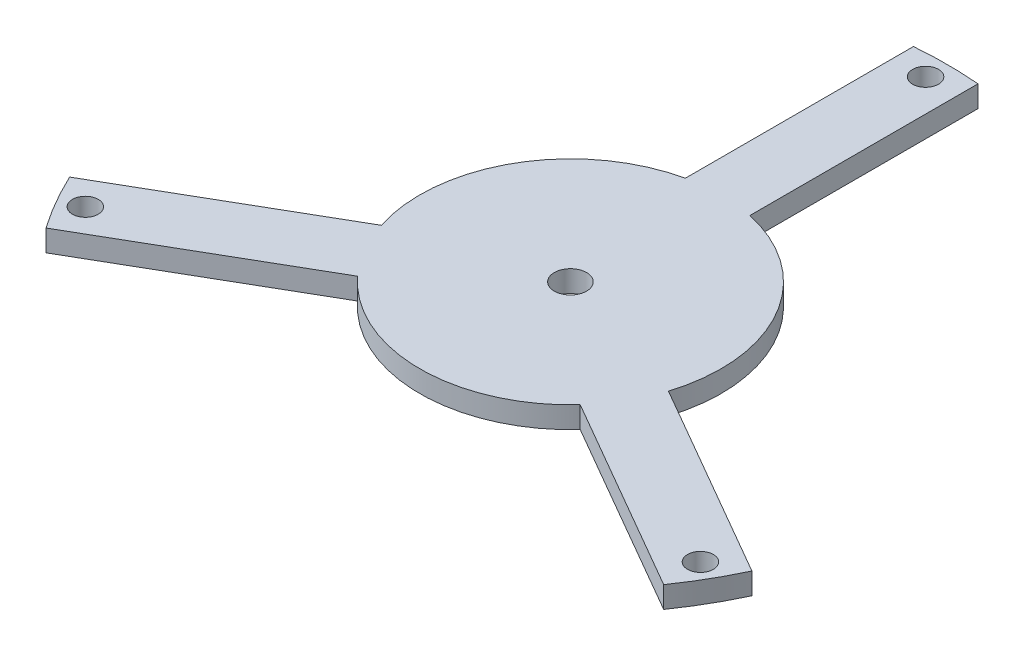
ISO-10303-21;
HEADER;
FILE_DESCRIPTION(('STEP AP214'),'2;1');
FILE_NAME('part.step','',(''),(''),'','','');
FILE_SCHEMA(('AUTOMOTIVE_DESIGN { 1 0 10303 214 1 1 1 1 }'));
ENDSEC;
DATA;
#1=APPLICATION_CONTEXT('core data for automotive mechanical design processes');
#2=APPLICATION_PROTOCOL_DEFINITION('international standard','automotive_design',2000,#1);
#3=PRODUCT_CONTEXT('',#1,'mechanical');
#4=PRODUCT('Part','Part','',(#3));
#5=PRODUCT_RELATED_PRODUCT_CATEGORY('part','',(#4));
#6=PRODUCT_DEFINITION_FORMATION('','',#4);
#7=PRODUCT_DEFINITION_CONTEXT('part definition',#1,'design');
#8=PRODUCT_DEFINITION('design','',#6,#7);
#9=PRODUCT_DEFINITION_SHAPE('','',#8);
#10=(LENGTH_UNIT() NAMED_UNIT(*) SI_UNIT(.MILLI.,.METRE.));
#11=(NAMED_UNIT(*) PLANE_ANGLE_UNIT() SI_UNIT($,.RADIAN.));
#12=(NAMED_UNIT(*) SI_UNIT($,.STERADIAN.) SOLID_ANGLE_UNIT());
#13=UNCERTAINTY_MEASURE_WITH_UNIT(LENGTH_MEASURE(1.E-05),#10,'distance_accuracy_value','');
#14=(GEOMETRIC_REPRESENTATION_CONTEXT(3) GLOBAL_UNCERTAINTY_ASSIGNED_CONTEXT((#13)) GLOBAL_UNIT_ASSIGNED_CONTEXT((#10,
#11,#12)) REPRESENTATION_CONTEXT('',''));
#15=CARTESIAN_POINT('',(0.,0.,0.));
#16=DIRECTION('',(0.,0.,1.));
#17=DIRECTION('',(1.,0.,0.));
#18=AXIS2_PLACEMENT_3D('',#15,#16,#17);
#19=CARTESIAN_POINT('',(0.,10.,0.));
#20=DIRECTION('',(0.,1.,0.));
#21=DIRECTION('',(0.,0.,1.));
#22=AXIS2_PLACEMENT_3D('',#19,#20,#21);
#23=PLANE('',#22);
#24=CARTESIAN_POINT('',(0.,10.,0.));
#25=DIRECTION('',(0.,1.,0.));
#26=DIRECTION('',(0.,0.,1.));
#27=AXIS2_PLACEMENT_3D('',#24,#25,#26);
#28=CIRCLE('',#27,7.5);
#29=CARTESIAN_POINT('',(0.,10.,7.5));
#30=VERTEX_POINT('',#29);
#31=EDGE_CURVE('E287',#30,#30,#28,.T.);
#32=ORIENTED_EDGE('',*,*,#31,.F.);
#33=EDGE_LOOP('',(#32));
#34=FACE_BOUND('',#33,.T.);
#35=CARTESIAN_POINT('',(142.894191624441,10.,82.4999999999948));
#36=DIRECTION('',(0.,1.,0.));
#37=DIRECTION('',(0.,0.,1.));
#38=AXIS2_PLACEMENT_3D('',#35,#36,#37);
#39=CIRCLE('',#38,6.00000000000002);
#40=CARTESIAN_POINT('',(142.894191624441,10.,88.4999999999949));
#41=VERTEX_POINT('',#40);
#42=EDGE_CURVE('E298',#41,#41,#39,.T.);
#43=ORIENTED_EDGE('',*,*,#42,.F.);
#44=EDGE_LOOP('',(#43));
#45=FACE_BOUND('',#44,.T.);
#46=CARTESIAN_POINT('',(0.,10.,0.));
#47=DIRECTION('',(0.,1.,0.));
#48=DIRECTION('',(0.,0.,1.));
#49=AXIS2_PLACEMENT_3D('',#46,#47,#48);
#50=CIRCLE('',#49,175.);
#51=CARTESIAN_POINT('',(15.,10.,-174.355957741627));
#52=VERTEX_POINT('',#51);
#53=CARTESIAN_POINT('',(-15.,10.,-174.355957741627));
#54=VERTEX_POINT('',#53);
#55=EDGE_CURVE('E179',#52,#54,#50,.T.);
#56=ORIENTED_EDGE('',*,*,#55,.T.);
#57=DIRECTION('',(0.,0.,1.));
#58=VECTOR('',#57,1.);
#59=CARTESIAN_POINT('',(-15.,10.,-174.355957741627));
#60=LINE('',#59,#58);
#61=CARTESIAN_POINT('',(-15.,10.,-68.3739716558867));
#62=VERTEX_POINT('',#61);
#63=EDGE_CURVE('E107',#54,#62,#60,.T.);
#64=ORIENTED_EDGE('',*,*,#63,.T.);
#65=CARTESIAN_POINT('',(0.,10.,0.));
#66=DIRECTION('',(0.,1.,0.));
#67=DIRECTION('',(0.,0.,1.));
#68=AXIS2_PLACEMENT_3D('',#65,#66,#67);
#69=CIRCLE('',#68,70.);
#70=CARTESIAN_POINT('',(-66.7135964116335,10.,21.1966047711816));
#71=VERTEX_POINT('',#70);
#72=EDGE_CURVE('E206',#62,#71,#69,.T.);
#73=ORIENTED_EDGE('',*,*,#72,.T.);
#74=DIRECTION('',(-0.866025403784439,0.,0.5));
#75=VECTOR('',#74,1.);
#76=CARTESIAN_POINT('',(-158.496688705413,10.,74.1875978140514));
#77=LINE('',#76,#75);
#78=CARTESIAN_POINT('',(-158.496688705413,10.,74.1875978140514));
#79=VERTEX_POINT('',#78);
#80=EDGE_CURVE('E225',#71,#79,#77,.T.);
#81=ORIENTED_EDGE('',*,*,#80,.T.);
#82=CARTESIAN_POINT('',(0.,10.,0.));
#83=DIRECTION('',(0.,1.,0.));
#84=DIRECTION('',(0.,0.,1.));
#85=AXIS2_PLACEMENT_3D('',#82,#83,#84);
#86=CIRCLE('',#85,175.);
#87=CARTESIAN_POINT('',(-143.496688705412,10.,100.168359927584));
#88=VERTEX_POINT('',#87);
#89=EDGE_CURVE('E222',#79,#88,#86,.T.);
#90=ORIENTED_EDGE('',*,*,#89,.T.);
#91=DIRECTION('',(0.866025403784439,0.,-0.5));
#92=VECTOR('',#91,1.);
#93=CARTESIAN_POINT('',(-143.496688705412,10.,100.168359927584));
#94=LINE('',#93,#92);
#95=CARTESIAN_POINT('',(-51.7135964116316,10.,47.1773668847137));
#96=VERTEX_POINT('',#95);
#97=EDGE_CURVE('E224',#88,#96,#94,.T.);
#98=ORIENTED_EDGE('',*,*,#97,.T.);
#99=CARTESIAN_POINT('',(0.,10.,0.));
#100=DIRECTION('',(0.,1.,0.));
#101=DIRECTION('',(0.,0.,1.));
#102=AXIS2_PLACEMENT_3D('',#99,#100,#101);
#103=CIRCLE('',#102,70.);
#104=CARTESIAN_POINT('',(51.7135964116393,10.,47.1773668847053));
#105=VERTEX_POINT('',#104);
#106=EDGE_CURVE('E227',#96,#105,#103,.T.);
#107=ORIENTED_EDGE('',*,*,#106,.T.);
#108=DIRECTION('',(0.866025403784439,0.,0.5));
#109=VECTOR('',#108,1.);
#110=CARTESIAN_POINT('',(143.496688705419,10.,100.168359927575));
#111=LINE('',#110,#109);
#112=CARTESIAN_POINT('',(143.496688705419,10.,100.168359927575));
#113=VERTEX_POINT('',#112);
#114=EDGE_CURVE('E233',#105,#113,#111,.T.);
#115=ORIENTED_EDGE('',*,*,#114,.T.);
#116=CARTESIAN_POINT('',(0.,10.,0.));
#117=DIRECTION('',(0.,1.,0.));
#118=DIRECTION('',(0.,0.,1.));
#119=AXIS2_PLACEMENT_3D('',#116,#117,#118);
#120=CIRCLE('',#119,175.);
#121=CARTESIAN_POINT('',(158.496688705418,10.,74.1875978140412));
#122=VERTEX_POINT('',#121);
#123=EDGE_CURVE('E138',#113,#122,#120,.T.);
#124=ORIENTED_EDGE('',*,*,#123,.T.);
#125=DIRECTION('',(-0.866025403784439,0.,-0.5));
#126=VECTOR('',#125,1.);
#127=CARTESIAN_POINT('',(158.496688705418,10.,74.1875978140413));
#128=LINE('',#127,#126);
#129=CARTESIAN_POINT('',(66.713596411637,10.,21.1966047711708));
#130=VERTEX_POINT('',#129);
#131=EDGE_CURVE('E132',#122,#130,#128,.T.);
#132=ORIENTED_EDGE('',*,*,#131,.T.);
#133=CARTESIAN_POINT('',(0.,10.,0.));
#134=DIRECTION('',(0.,1.,0.));
#135=DIRECTION('',(0.,0.,1.));
#136=AXIS2_PLACEMENT_3D('',#133,#134,#135);
#137=CIRCLE('',#136,70.);
#138=CARTESIAN_POINT('',(15.,10.,-68.3739716558867));
#139=VERTEX_POINT('',#138);
#140=EDGE_CURVE('E136',#130,#139,#137,.T.);
#141=ORIENTED_EDGE('',*,*,#140,.T.);
#142=DIRECTION('',(0.,0.,-1.));
#143=VECTOR('',#142,1.);
#144=CARTESIAN_POINT('',(15.,10.,-174.355957741627));
#145=LINE('',#144,#143);
#146=EDGE_CURVE('E52',#139,#52,#145,.T.);
#147=ORIENTED_EDGE('',*,*,#146,.T.);
#148=EDGE_LOOP('',(#56,#64,#73,#81,#90,#98,#107,#115,#124,#132,#141,#147));
#149=FACE_BOUND('',#148,.T.);
#150=CARTESIAN_POINT('',(0.,10.,-165.));
#151=DIRECTION('',(0.,1.,0.));
#152=DIRECTION('',(0.,0.,1.));
#153=AXIS2_PLACEMENT_3D('',#150,#151,#152);
#154=CIRCLE('',#153,6.);
#155=CARTESIAN_POINT('',(0.,10.,-159.));
#156=VERTEX_POINT('',#155);
#157=EDGE_CURVE('E160',#156,#156,#154,.T.);
#158=ORIENTED_EDGE('',*,*,#157,.F.);
#159=EDGE_LOOP('',(#158));
#160=FACE_BOUND('',#159,.T.);
#161=CARTESIAN_POINT('',(-142.894191624423,10.,82.5000000000052));
#162=DIRECTION('',(0.,1.,0.));
#163=DIRECTION('',(0.,0.,1.));
#164=AXIS2_PLACEMENT_3D('',#161,#162,#163);
#165=CIRCLE('',#164,6.00000000000002);
#166=CARTESIAN_POINT('',(-142.894191624423,10.,88.5000000000052));
#167=VERTEX_POINT('',#166);
#168=EDGE_CURVE('E292',#167,#167,#165,.T.);
#169=ORIENTED_EDGE('',*,*,#168,.F.);
#170=EDGE_LOOP('',(#169));
#171=FACE_BOUND('',#170,.T.);
#172=ADVANCED_FACE('F35',(#34,#45,#149,#160,#171),#23,.T.);
#173=CARTESIAN_POINT('',(0.,0.,0.));
#174=DIRECTION('',(0.,1.,0.));
#175=DIRECTION('',(0.,0.,1.));
#176=AXIS2_PLACEMENT_3D('',#173,#174,#175);
#177=PLANE('',#176);
#178=CARTESIAN_POINT('',(0.,0.,0.));
#179=DIRECTION('',(0.,1.,0.));
#180=DIRECTION('',(0.,0.,1.));
#181=AXIS2_PLACEMENT_3D('',#178,#179,#180);
#182=CIRCLE('',#181,7.5);
#183=CARTESIAN_POINT('',(0.,0.,7.5));
#184=VERTEX_POINT('',#183);
#185=EDGE_CURVE('E285',#184,#184,#182,.T.);
#186=ORIENTED_EDGE('',*,*,#185,.T.);
#187=EDGE_LOOP('',(#186));
#188=FACE_BOUND('',#187,.T.);
#189=CARTESIAN_POINT('',(142.894191624441,0.,82.4999999999948));
#190=DIRECTION('',(0.,1.,0.));
#191=DIRECTION('',(0.,0.,1.));
#192=AXIS2_PLACEMENT_3D('',#189,#190,#191);
#193=CIRCLE('',#192,6.00000000000002);
#194=CARTESIAN_POINT('',(142.894191624441,0.,88.4999999999949));
#195=VERTEX_POINT('',#194);
#196=EDGE_CURVE('E295',#195,#195,#193,.T.);
#197=ORIENTED_EDGE('',*,*,#196,.T.);
#198=EDGE_LOOP('',(#197));
#199=FACE_BOUND('',#198,.T.);
#200=CARTESIAN_POINT('',(0.,0.,0.));
#201=DIRECTION('',(0.,1.,0.));
#202=DIRECTION('',(0.,0.,1.));
#203=AXIS2_PLACEMENT_3D('',#200,#201,#202);
#204=CIRCLE('',#203,175.);
#205=CARTESIAN_POINT('',(15.,0.,-174.355957741627));
#206=VERTEX_POINT('',#205);
#207=CARTESIAN_POINT('',(-15.,0.,-174.355957741627));
#208=VERTEX_POINT('',#207);
#209=EDGE_CURVE('E156',#206,#208,#204,.T.);
#210=ORIENTED_EDGE('',*,*,#209,.F.);
#211=DIRECTION('',(0.,0.,-1.));
#212=VECTOR('',#211,1.);
#213=CARTESIAN_POINT('',(15.,0.,-174.355957741627));
#214=LINE('',#213,#212);
#215=CARTESIAN_POINT('',(15.,0.,-68.3739716558867));
#216=VERTEX_POINT('',#215);
#217=EDGE_CURVE('E99',#216,#206,#214,.T.);
#218=ORIENTED_EDGE('',*,*,#217,.F.);
#219=CARTESIAN_POINT('',(0.,0.,0.));
#220=DIRECTION('',(0.,1.,0.));
#221=DIRECTION('',(0.,0.,1.));
#222=AXIS2_PLACEMENT_3D('',#219,#220,#221);
#223=CIRCLE('',#222,70.);
#224=CARTESIAN_POINT('',(66.713596411637,0.,21.1966047711708));
#225=VERTEX_POINT('',#224);
#226=EDGE_CURVE('E93',#225,#216,#223,.T.);
#227=ORIENTED_EDGE('',*,*,#226,.F.);
#228=DIRECTION('',(-0.866025403784439,0.,-0.5));
#229=VECTOR('',#228,1.);
#230=CARTESIAN_POINT('',(158.496688705418,0.,74.1875978140413));
#231=LINE('',#230,#229);
#232=CARTESIAN_POINT('',(158.496688705418,0.,74.1875978140412));
#233=VERTEX_POINT('',#232);
#234=EDGE_CURVE('E146',#233,#225,#231,.T.);
#235=ORIENTED_EDGE('',*,*,#234,.F.);
#236=CARTESIAN_POINT('',(0.,0.,0.));
#237=DIRECTION('',(0.,1.,0.));
#238=DIRECTION('',(0.,0.,1.));
#239=AXIS2_PLACEMENT_3D('',#236,#237,#238);
#240=CIRCLE('',#239,175.);
#241=CARTESIAN_POINT('',(143.496688705419,0.,100.168359927575));
#242=VERTEX_POINT('',#241);
#243=EDGE_CURVE('E174',#242,#233,#240,.T.);
#244=ORIENTED_EDGE('',*,*,#243,.F.);
#245=DIRECTION('',(0.866025403784439,0.,0.5));
#246=VECTOR('',#245,1.);
#247=CARTESIAN_POINT('',(143.496688705419,0.,100.168359927575));
#248=LINE('',#247,#246);
#249=CARTESIAN_POINT('',(51.7135964116393,0.,47.1773668847053));
#250=VERTEX_POINT('',#249);
#251=EDGE_CURVE('E172',#250,#242,#248,.T.);
#252=ORIENTED_EDGE('',*,*,#251,.F.);
#253=CARTESIAN_POINT('',(0.,0.,0.));
#254=DIRECTION('',(0.,1.,0.));
#255=DIRECTION('',(0.,0.,1.));
#256=AXIS2_PLACEMENT_3D('',#253,#254,#255);
#257=CIRCLE('',#256,70.);
#258=CARTESIAN_POINT('',(-51.7135964116316,0.,47.1773668847137));
#259=VERTEX_POINT('',#258);
#260=EDGE_CURVE('E170',#259,#250,#257,.T.);
#261=ORIENTED_EDGE('',*,*,#260,.F.);
#262=DIRECTION('',(0.866025403784439,0.,-0.5));
#263=VECTOR('',#262,1.);
#264=CARTESIAN_POINT('',(-143.496688705412,0.,100.168359927584));
#265=LINE('',#264,#263);
#266=CARTESIAN_POINT('',(-143.496688705412,0.,100.168359927584));
#267=VERTEX_POINT('',#266);
#268=EDGE_CURVE('E168',#267,#259,#265,.T.);
#269=ORIENTED_EDGE('',*,*,#268,.F.);
#270=CARTESIAN_POINT('',(0.,0.,0.));
#271=DIRECTION('',(0.,1.,0.));
#272=DIRECTION('',(0.,0.,1.));
#273=AXIS2_PLACEMENT_3D('',#270,#271,#272);
#274=CIRCLE('',#273,175.);
#275=CARTESIAN_POINT('',(-158.496688705413,0.,74.1875978140514));
#276=VERTEX_POINT('',#275);
#277=EDGE_CURVE('E166',#276,#267,#274,.T.);
#278=ORIENTED_EDGE('',*,*,#277,.F.);
#279=DIRECTION('',(-0.866025403784439,0.,0.5));
#280=VECTOR('',#279,1.);
#281=CARTESIAN_POINT('',(-158.496688705413,0.,74.1875978140514));
#282=LINE('',#281,#280);
#283=CARTESIAN_POINT('',(-66.7135964116335,0.,21.1966047711816));
#284=VERTEX_POINT('',#283);
#285=EDGE_CURVE('E164',#284,#276,#282,.T.);
#286=ORIENTED_EDGE('',*,*,#285,.F.);
#287=CARTESIAN_POINT('',(0.,0.,0.));
#288=DIRECTION('',(0.,1.,0.));
#289=DIRECTION('',(0.,0.,1.));
#290=AXIS2_PLACEMENT_3D('',#287,#288,#289);
#291=CIRCLE('',#290,70.);
#292=CARTESIAN_POINT('',(-15.,0.,-68.3739716558867));
#293=VERTEX_POINT('',#292);
#294=EDGE_CURVE('E162',#293,#284,#291,.T.);
#295=ORIENTED_EDGE('',*,*,#294,.F.);
#296=DIRECTION('',(0.,0.,1.));
#297=VECTOR('',#296,1.);
#298=CARTESIAN_POINT('',(-15.,0.,-174.355957741627));
#299=LINE('',#298,#297);
#300=EDGE_CURVE('E159',#208,#293,#299,.T.);
#301=ORIENTED_EDGE('',*,*,#300,.F.);
#302=EDGE_LOOP('',(#210,#218,#227,#235,#244,#252,#261,#269,#278,#286,#295,#301));
#303=FACE_BOUND('',#302,.T.);
#304=CARTESIAN_POINT('',(0.,0.,-165.));
#305=DIRECTION('',(0.,1.,0.));
#306=DIRECTION('',(0.,0.,1.));
#307=AXIS2_PLACEMENT_3D('',#304,#305,#306);
#308=CIRCLE('',#307,6.);
#309=CARTESIAN_POINT('',(0.,0.,-159.));
#310=VERTEX_POINT('',#309);
#311=EDGE_CURVE('E301',#310,#310,#308,.T.);
#312=ORIENTED_EDGE('',*,*,#311,.T.);
#313=EDGE_LOOP('',(#312));
#314=FACE_BOUND('',#313,.T.);
#315=CARTESIAN_POINT('',(-142.894191624423,0.,82.5000000000052));
#316=DIRECTION('',(0.,1.,0.));
#317=DIRECTION('',(0.,0.,1.));
#318=AXIS2_PLACEMENT_3D('',#315,#316,#317);
#319=CIRCLE('',#318,6.00000000000002);
#320=CARTESIAN_POINT('',(-142.894191624423,0.,88.5000000000052));
#321=VERTEX_POINT('',#320);
#322=EDGE_CURVE('E289',#321,#321,#319,.T.);
#323=ORIENTED_EDGE('',*,*,#322,.T.);
#324=EDGE_LOOP('',(#323));
#325=FACE_BOUND('',#324,.T.);
#326=ADVANCED_FACE('F210',(#188,#199,#303,#314,#325),#177,.F.);
#327=CARTESIAN_POINT('',(0.,10.,0.));
#328=DIRECTION('',(0.,-1.,0.));
#329=DIRECTION('',(0.,0.,-1.));
#330=AXIS2_PLACEMENT_3D('',#327,#328,#329);
#331=CYLINDRICAL_SURFACE('',#330,175.);
#332=ORIENTED_EDGE('',*,*,#209,.T.);
#333=DIRECTION('',(0.,-1.,0.));
#334=VECTOR('',#333,1.);
#335=CARTESIAN_POINT('',(-15.,10.,-174.355957741627));
#336=LINE('',#335,#334);
#337=EDGE_CURVE('E11',#54,#208,#336,.T.);
#338=ORIENTED_EDGE('',*,*,#337,.F.);
#339=ORIENTED_EDGE('',*,*,#55,.F.);
#340=DIRECTION('',(0.,-1.,0.));
#341=VECTOR('',#340,1.);
#342=CARTESIAN_POINT('',(15.,10.,-174.355957741627));
#343=LINE('',#342,#341);
#344=EDGE_CURVE('E152',#52,#206,#343,.T.);
#345=ORIENTED_EDGE('',*,*,#344,.T.);
#346=EDGE_LOOP('',(#332,#338,#339,#345));
#347=FACE_BOUND('',#346,.T.);
#348=ADVANCED_FACE('F37',(#347),#331,.T.);
#349=CARTESIAN_POINT('',(-15.,10.,-174.355957741627));
#350=DIRECTION('',(1.,0.,0.));
#351=DIRECTION('',(0.,0.,-1.));
#352=AXIS2_PLACEMENT_3D('',#349,#350,#351);
#353=PLANE('',#352);
#354=ORIENTED_EDGE('',*,*,#300,.T.);
#355=DIRECTION('',(0.,-1.,0.));
#356=VECTOR('',#355,1.);
#357=CARTESIAN_POINT('',(-15.,10.,-68.3739716558867));
#358=LINE('',#357,#356);
#359=EDGE_CURVE('E44',#62,#293,#358,.T.);
#360=ORIENTED_EDGE('',*,*,#359,.F.);
#361=ORIENTED_EDGE('',*,*,#63,.F.);
#362=ORIENTED_EDGE('',*,*,#337,.T.);
#363=EDGE_LOOP('',(#354,#360,#361,#362));
#364=FACE_BOUND('',#363,.T.);
#365=ADVANCED_FACE('F413',(#364),#353,.F.);
#366=CARTESIAN_POINT('',(0.,10.,0.));
#367=DIRECTION('',(0.,-1.,0.));
#368=DIRECTION('',(0.,0.,-1.));
#369=AXIS2_PLACEMENT_3D('',#366,#367,#368);
#370=CYLINDRICAL_SURFACE('',#369,70.);
#371=ORIENTED_EDGE('',*,*,#294,.T.);
#372=DIRECTION('',(0.,-1.,0.));
#373=VECTOR('',#372,1.);
#374=CARTESIAN_POINT('',(-66.7135964116335,10.,21.1966047711816));
#375=LINE('',#374,#373);
#376=EDGE_CURVE('E198',#71,#284,#375,.T.);
#377=ORIENTED_EDGE('',*,*,#376,.F.);
#378=ORIENTED_EDGE('',*,*,#72,.F.);
#379=ORIENTED_EDGE('',*,*,#359,.T.);
#380=EDGE_LOOP('',(#371,#377,#378,#379));
#381=FACE_BOUND('',#380,.T.);
#382=ADVANCED_FACE('F204',(#381),#370,.T.);
#383=CARTESIAN_POINT('',(-158.496688705413,10.,74.1875978140514));
#384=DIRECTION('',(0.5,0.,0.866025403784439));
#385=DIRECTION('',(0.866025403784439,0.,-0.5));
#386=AXIS2_PLACEMENT_3D('',#383,#384,#385);
#387=PLANE('',#386);
#388=ORIENTED_EDGE('',*,*,#285,.T.);
#389=DIRECTION('',(0.,-1.,0.));
#390=VECTOR('',#389,1.);
#391=CARTESIAN_POINT('',(-158.496688705413,10.,74.1875978140514));
#392=LINE('',#391,#390);
#393=EDGE_CURVE('E195',#79,#276,#392,.T.);
#394=ORIENTED_EDGE('',*,*,#393,.F.);
#395=ORIENTED_EDGE('',*,*,#80,.F.);
#396=ORIENTED_EDGE('',*,*,#376,.T.);
#397=EDGE_LOOP('',(#388,#394,#395,#396));
#398=FACE_BOUND('',#397,.T.);
#399=ADVANCED_FACE('F216',(#398),#387,.F.);
#400=CARTESIAN_POINT('',(0.,10.,0.));
#401=DIRECTION('',(0.,-1.,0.));
#402=DIRECTION('',(0.,0.,-1.));
#403=AXIS2_PLACEMENT_3D('',#400,#401,#402);
#404=CYLINDRICAL_SURFACE('',#403,175.);
#405=ORIENTED_EDGE('',*,*,#277,.T.);
#406=DIRECTION('',(0.,-1.,0.));
#407=VECTOR('',#406,1.);
#408=CARTESIAN_POINT('',(-143.496688705412,10.,100.168359927584));
#409=LINE('',#408,#407);
#410=EDGE_CURVE('E192',#88,#267,#409,.T.);
#411=ORIENTED_EDGE('',*,*,#410,.F.);
#412=ORIENTED_EDGE('',*,*,#89,.F.);
#413=ORIENTED_EDGE('',*,*,#393,.T.);
#414=EDGE_LOOP('',(#405,#411,#412,#413));
#415=FACE_BOUND('',#414,.T.);
#416=ADVANCED_FACE('F220',(#415),#404,.T.);
#417=CARTESIAN_POINT('',(-143.496688705412,10.,100.168359927584));
#418=DIRECTION('',(-0.5,0.,-0.866025403784439));
#419=DIRECTION('',(-0.866025403784439,0.,0.5));
#420=AXIS2_PLACEMENT_3D('',#417,#418,#419);
#421=PLANE('',#420);
#422=ORIENTED_EDGE('',*,*,#268,.T.);
#423=DIRECTION('',(0.,-1.,0.));
#424=VECTOR('',#423,1.);
#425=CARTESIAN_POINT('',(-51.7135964116316,10.,47.1773668847137));
#426=LINE('',#425,#424);
#427=EDGE_CURVE('E189',#96,#259,#426,.T.);
#428=ORIENTED_EDGE('',*,*,#427,.F.);
#429=ORIENTED_EDGE('',*,*,#97,.F.);
#430=ORIENTED_EDGE('',*,*,#410,.T.);
#431=EDGE_LOOP('',(#422,#428,#429,#430));
#432=FACE_BOUND('',#431,.T.);
#433=ADVANCED_FACE('F378',(#432),#421,.F.);
#434=CARTESIAN_POINT('',(0.,10.,0.));
#435=DIRECTION('',(0.,-1.,0.));
#436=DIRECTION('',(0.,0.,-1.));
#437=AXIS2_PLACEMENT_3D('',#434,#435,#436);
#438=CYLINDRICAL_SURFACE('',#437,70.);
#439=ORIENTED_EDGE('',*,*,#260,.T.);
#440=DIRECTION('',(0.,-1.,0.));
#441=VECTOR('',#440,1.);
#442=CARTESIAN_POINT('',(51.7135964116393,10.,47.1773668847053));
#443=LINE('',#442,#441);
#444=EDGE_CURVE('E186',#105,#250,#443,.T.);
#445=ORIENTED_EDGE('',*,*,#444,.F.);
#446=ORIENTED_EDGE('',*,*,#106,.F.);
#447=ORIENTED_EDGE('',*,*,#427,.T.);
#448=EDGE_LOOP('',(#439,#445,#446,#447));
#449=FACE_BOUND('',#448,.T.);
#450=ADVANCED_FACE('F369',(#449),#438,.T.);
#451=CARTESIAN_POINT('',(143.496688705419,10.,100.168359927575));
#452=DIRECTION('',(0.5,0.,-0.866025403784439));
#453=DIRECTION('',(-0.866025403784439,0.,-0.5));
#454=AXIS2_PLACEMENT_3D('',#451,#452,#453);
#455=PLANE('',#454);
#456=ORIENTED_EDGE('',*,*,#251,.T.);
#457=DIRECTION('',(0.,-1.,0.));
#458=VECTOR('',#457,1.);
#459=CARTESIAN_POINT('',(143.496688705419,10.,100.168359927575));
#460=LINE('',#459,#458);
#461=EDGE_CURVE('E183',#113,#242,#460,.T.);
#462=ORIENTED_EDGE('',*,*,#461,.F.);
#463=ORIENTED_EDGE('',*,*,#114,.F.);
#464=ORIENTED_EDGE('',*,*,#444,.T.);
#465=EDGE_LOOP('',(#456,#462,#463,#464));
#466=FACE_BOUND('',#465,.T.);
#467=ADVANCED_FACE('F239',(#466),#455,.F.);
#468=CARTESIAN_POINT('',(0.,10.,0.));
#469=DIRECTION('',(0.,-1.,0.));
#470=DIRECTION('',(0.,0.,-1.));
#471=AXIS2_PLACEMENT_3D('',#468,#469,#470);
#472=CYLINDRICAL_SURFACE('',#471,175.);
#473=ORIENTED_EDGE('',*,*,#243,.T.);
#474=DIRECTION('',(0.,-1.,0.));
#475=VECTOR('',#474,1.);
#476=CARTESIAN_POINT('',(158.496688705418,10.,74.1875978140412));
#477=LINE('',#476,#475);
#478=EDGE_CURVE('E147',#122,#233,#477,.T.);
#479=ORIENTED_EDGE('',*,*,#478,.F.);
#480=ORIENTED_EDGE('',*,*,#123,.F.);
#481=ORIENTED_EDGE('',*,*,#461,.T.);
#482=EDGE_LOOP('',(#473,#479,#480,#481));
#483=FACE_BOUND('',#482,.T.);
#484=ADVANCED_FACE('F243',(#483),#472,.T.);
#485=CARTESIAN_POINT('',(158.496688705418,10.,74.1875978140413));
#486=DIRECTION('',(-0.5,0.,0.866025403784439));
#487=DIRECTION('',(0.866025403784439,0.,0.5));
#488=AXIS2_PLACEMENT_3D('',#485,#486,#487);
#489=PLANE('',#488);
#490=ORIENTED_EDGE('',*,*,#234,.T.);
#491=DIRECTION('',(0.,-1.,0.));
#492=VECTOR('',#491,1.);
#493=CARTESIAN_POINT('',(66.713596411637,10.,21.1966047711708));
#494=LINE('',#493,#492);
#495=EDGE_CURVE('E143',#130,#225,#494,.T.);
#496=ORIENTED_EDGE('',*,*,#495,.F.);
#497=ORIENTED_EDGE('',*,*,#131,.F.);
#498=ORIENTED_EDGE('',*,*,#478,.T.);
#499=EDGE_LOOP('',(#490,#496,#497,#498));
#500=FACE_BOUND('',#499,.T.);
#501=ADVANCED_FACE('F144',(#500),#489,.F.);
#502=CARTESIAN_POINT('',(0.,10.,0.));
#503=DIRECTION('',(0.,-1.,0.));
#504=DIRECTION('',(0.,0.,-1.));
#505=AXIS2_PLACEMENT_3D('',#502,#503,#504);
#506=CYLINDRICAL_SURFACE('',#505,70.);
#507=ORIENTED_EDGE('',*,*,#226,.T.);
#508=DIRECTION('',(0.,-1.,0.));
#509=VECTOR('',#508,1.);
#510=CARTESIAN_POINT('',(15.,10.,-68.3739716558867));
#511=LINE('',#510,#509);
#512=EDGE_CURVE('E148',#139,#216,#511,.T.);
#513=ORIENTED_EDGE('',*,*,#512,.F.);
#514=ORIENTED_EDGE('',*,*,#140,.F.);
#515=ORIENTED_EDGE('',*,*,#495,.T.);
#516=EDGE_LOOP('',(#507,#513,#514,#515));
#517=FACE_BOUND('',#516,.T.);
#518=ADVANCED_FACE('F150',(#517),#506,.T.);
#519=CARTESIAN_POINT('',(15.,10.,-174.355957741627));
#520=DIRECTION('',(-1.,0.,0.));
#521=DIRECTION('',(0.,0.,1.));
#522=AXIS2_PLACEMENT_3D('',#519,#520,#521);
#523=PLANE('',#522);
#524=ORIENTED_EDGE('',*,*,#217,.T.);
#525=ORIENTED_EDGE('',*,*,#344,.F.);
#526=ORIENTED_EDGE('',*,*,#146,.F.);
#527=ORIENTED_EDGE('',*,*,#512,.T.);
#528=EDGE_LOOP('',(#524,#525,#526,#527));
#529=FACE_BOUND('',#528,.T.);
#530=ADVANCED_FACE('F247',(#529),#523,.F.);
#531=CARTESIAN_POINT('',(0.,10.,-165.));
#532=DIRECTION('',(0.,-1.,0.));
#533=DIRECTION('',(0.,0.,-1.));
#534=AXIS2_PLACEMENT_3D('',#531,#532,#533);
#535=CYLINDRICAL_SURFACE('',#534,6.);
#536=ORIENTED_EDGE('',*,*,#157,.T.);
#537=EDGE_LOOP('',(#536));
#538=FACE_BOUND('',#537,.T.);
#539=ORIENTED_EDGE('',*,*,#311,.F.);
#540=EDGE_LOOP('',(#539));
#541=FACE_BOUND('',#540,.T.);
#542=ADVANCED_FACE('F249',(#538,#541),#535,.F.);
#543=CARTESIAN_POINT('',(142.894191624441,10.,82.4999999999948));
#544=DIRECTION('',(0.,-1.,0.));
#545=DIRECTION('',(0.,0.,-1.));
#546=AXIS2_PLACEMENT_3D('',#543,#544,#545);
#547=CYLINDRICAL_SURFACE('',#546,6.00000000000002);
#548=ORIENTED_EDGE('',*,*,#42,.T.);
#549=EDGE_LOOP('',(#548));
#550=FACE_BOUND('',#549,.T.);
#551=ORIENTED_EDGE('',*,*,#196,.F.);
#552=EDGE_LOOP('',(#551));
#553=FACE_BOUND('',#552,.T.);
#554=ADVANCED_FACE('F255',(#550,#553),#547,.F.);
#555=CARTESIAN_POINT('',(-142.894191624423,10.,82.5000000000052));
#556=DIRECTION('',(0.,-1.,0.));
#557=DIRECTION('',(0.,0.,-1.));
#558=AXIS2_PLACEMENT_3D('',#555,#556,#557);
#559=CYLINDRICAL_SURFACE('',#558,6.00000000000002);
#560=ORIENTED_EDGE('',*,*,#168,.T.);
#561=EDGE_LOOP('',(#560));
#562=FACE_BOUND('',#561,.T.);
#563=ORIENTED_EDGE('',*,*,#322,.F.);
#564=EDGE_LOOP('',(#563));
#565=FACE_BOUND('',#564,.T.);
#566=ADVANCED_FACE('F272',(#562,#565),#559,.F.);
#567=CARTESIAN_POINT('',(0.,0.,0.));
#568=DIRECTION('',(0.,1.,0.));
#569=DIRECTION('',(0.,0.,1.));
#570=AXIS2_PLACEMENT_3D('',#567,#568,#569);
#571=CYLINDRICAL_SURFACE('',#570,7.5);
#572=ORIENTED_EDGE('',*,*,#185,.F.);
#573=EDGE_LOOP('',(#572));
#574=FACE_BOUND('',#573,.T.);
#575=ORIENTED_EDGE('',*,*,#31,.T.);
#576=EDGE_LOOP('',(#575));
#577=FACE_BOUND('',#576,.T.);
#578=ADVANCED_FACE('F276',(#574,#577),#571,.F.);
#579=CLOSED_SHELL('',(#172,#326,#348,#365,#382,#399,#416,#433,#450,#467,#484,#501,#518,#530,
#542,#554,#566,#578));
#580=MANIFOLD_SOLID_BREP('B2',#579);
#581=ADVANCED_BREP_SHAPE_REPRESENTATION('',(#18,#580),#14);
#582=SHAPE_DEFINITION_REPRESENTATION(#9,#581);
ENDSEC;
END-ISO-10303-21;
